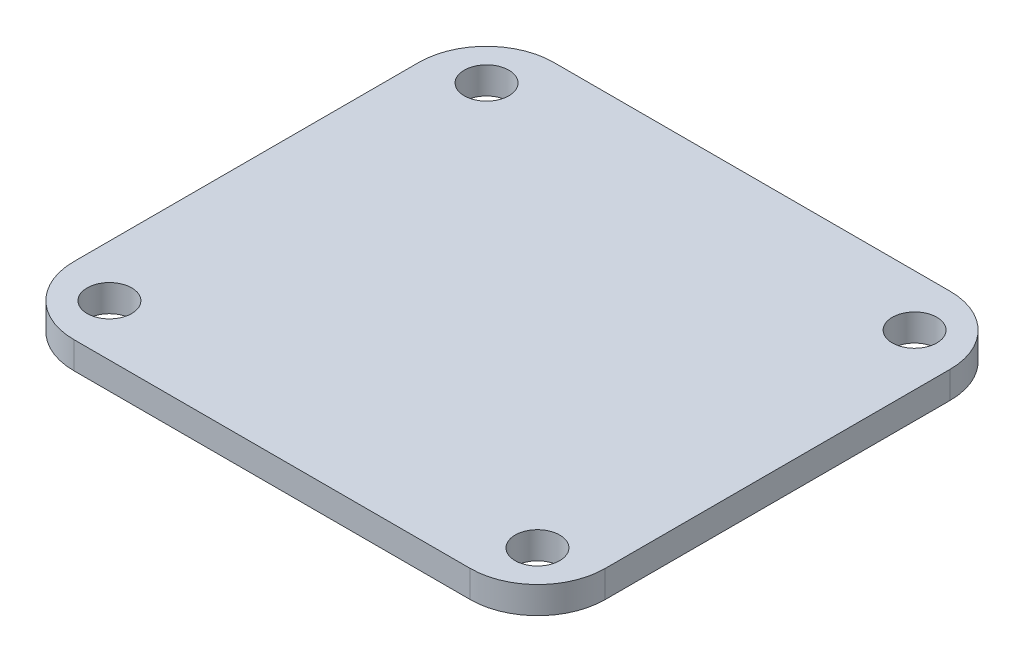
ISO-10303-21;
HEADER;
FILE_DESCRIPTION(('STEP AP214'),'2;1');
FILE_NAME('part.step','',(''),(''),'','','');
FILE_SCHEMA(('AUTOMOTIVE_DESIGN { 1 0 10303 214 1 1 1 1 }'));
ENDSEC;
DATA;
#1=APPLICATION_CONTEXT('core data for automotive mechanical design processes');
#2=APPLICATION_PROTOCOL_DEFINITION('international standard','automotive_design',2000,#1);
#3=PRODUCT_CONTEXT('',#1,'mechanical');
#4=PRODUCT('Part','Part','',(#3));
#5=PRODUCT_RELATED_PRODUCT_CATEGORY('part','',(#4));
#6=PRODUCT_DEFINITION_FORMATION('','',#4);
#7=PRODUCT_DEFINITION_CONTEXT('part definition',#1,'design');
#8=PRODUCT_DEFINITION('design','',#6,#7);
#9=PRODUCT_DEFINITION_SHAPE('','',#8);
#10=(LENGTH_UNIT() NAMED_UNIT(*) SI_UNIT(.MILLI.,.METRE.));
#11=(NAMED_UNIT(*) PLANE_ANGLE_UNIT() SI_UNIT($,.RADIAN.));
#12=(NAMED_UNIT(*) SI_UNIT($,.STERADIAN.) SOLID_ANGLE_UNIT());
#13=UNCERTAINTY_MEASURE_WITH_UNIT(LENGTH_MEASURE(1.E-05),#10,'distance_accuracy_value','');
#14=(GEOMETRIC_REPRESENTATION_CONTEXT(3) GLOBAL_UNCERTAINTY_ASSIGNED_CONTEXT((#13)) GLOBAL_UNIT_ASSIGNED_CONTEXT((#10,
#11,#12)) REPRESENTATION_CONTEXT('',''));
#15=CARTESIAN_POINT('',(0.,0.,0.));
#16=DIRECTION('',(0.,0.,1.));
#17=DIRECTION('',(1.,0.,0.));
#18=AXIS2_PLACEMENT_3D('',#15,#16,#17);
#19=CARTESIAN_POINT('',(0.,2.,0.));
#20=DIRECTION('',(0.,1.,0.));
#21=DIRECTION('',(0.,0.,1.));
#22=AXIS2_PLACEMENT_3D('',#19,#20,#21);
#23=PLANE('',#22);
#24=CARTESIAN_POINT('',(-15.855,2.,13.97));
#25=DIRECTION('',(0.,1.,0.));
#26=DIRECTION('',(0.,0.,1.));
#27=AXIS2_PLACEMENT_3D('',#24,#25,#26);
#28=CIRCLE('',#27,1.65);
#29=CARTESIAN_POINT('',(-15.855,2.,15.62));
#30=VERTEX_POINT('',#29);
#31=EDGE_CURVE('E180',#30,#30,#28,.T.);
#32=ORIENTED_EDGE('',*,*,#31,.F.);
#33=EDGE_LOOP('',(#32));
#34=FACE_BOUND('',#33,.T.);
#35=CARTESIAN_POINT('',(-15.855,2.,-13.97));
#36=DIRECTION('',(0.,1.,0.));
#37=DIRECTION('',(0.,0.,1.));
#38=AXIS2_PLACEMENT_3D('',#35,#36,#37);
#39=CIRCLE('',#38,1.65);
#40=CARTESIAN_POINT('',(-15.855,2.,-12.32));
#41=VERTEX_POINT('',#40);
#42=EDGE_CURVE('E163',#41,#41,#39,.T.);
#43=ORIENTED_EDGE('',*,*,#42,.F.);
#44=EDGE_LOOP('',(#43));
#45=FACE_BOUND('',#44,.T.);
#46=DIRECTION('',(-1.,0.,0.));
#47=VECTOR('',#46,1.);
#48=CARTESIAN_POINT('',(-19.685,2.,-17.78));
#49=LINE('',#48,#47);
#50=CARTESIAN_POINT('',(14.685,2.,-17.78));
#51=VERTEX_POINT('',#50);
#52=CARTESIAN_POINT('',(-14.685,2.,-17.78));
#53=VERTEX_POINT('',#52);
#54=EDGE_CURVE('E170',#51,#53,#49,.T.);
#55=ORIENTED_EDGE('',*,*,#54,.T.);
#56=CARTESIAN_POINT('',(-14.685,2.,-12.78));
#57=DIRECTION('',(0.,1.,0.));
#58=DIRECTION('',(0.,0.,1.));
#59=AXIS2_PLACEMENT_3D('',#56,#57,#58);
#60=CIRCLE('',#59,5.);
#61=CARTESIAN_POINT('',(-19.685,2.,-12.78));
#62=VERTEX_POINT('',#61);
#63=EDGE_CURVE('E147',#53,#62,#60,.T.);
#64=ORIENTED_EDGE('',*,*,#63,.T.);
#65=DIRECTION('',(0.,0.,1.));
#66=VECTOR('',#65,1.);
#67=CARTESIAN_POINT('',(-19.685,2.,-17.78));
#68=LINE('',#67,#66);
#69=CARTESIAN_POINT('',(-19.685,2.,12.78));
#70=VERTEX_POINT('',#69);
#71=EDGE_CURVE('E117',#62,#70,#68,.T.);
#72=ORIENTED_EDGE('',*,*,#71,.T.);
#73=CARTESIAN_POINT('',(-14.685,2.,12.78));
#74=DIRECTION('',(0.,1.,0.));
#75=DIRECTION('',(0.,0.,1.));
#76=AXIS2_PLACEMENT_3D('',#73,#74,#75);
#77=CIRCLE('',#76,5.);
#78=CARTESIAN_POINT('',(-14.685,2.,17.78));
#79=VERTEX_POINT('',#78);
#80=EDGE_CURVE('E54',#70,#79,#77,.T.);
#81=ORIENTED_EDGE('',*,*,#80,.T.);
#82=DIRECTION('',(1.,0.,0.));
#83=VECTOR('',#82,1.);
#84=CARTESIAN_POINT('',(-19.685,2.,17.78));
#85=LINE('',#84,#83);
#86=CARTESIAN_POINT('',(14.685,2.,17.78));
#87=VERTEX_POINT('',#86);
#88=EDGE_CURVE('E133',#79,#87,#85,.T.);
#89=ORIENTED_EDGE('',*,*,#88,.T.);
#90=CARTESIAN_POINT('',(14.685,2.,12.78));
#91=DIRECTION('',(0.,1.,0.));
#92=DIRECTION('',(0.,0.,1.));
#93=AXIS2_PLACEMENT_3D('',#90,#91,#92);
#94=CIRCLE('',#93,5.);
#95=CARTESIAN_POINT('',(19.685,2.,12.78));
#96=VERTEX_POINT('',#95);
#97=EDGE_CURVE('E142',#87,#96,#94,.T.);
#98=ORIENTED_EDGE('',*,*,#97,.T.);
#99=DIRECTION('',(0.,0.,-1.));
#100=VECTOR('',#99,1.);
#101=CARTESIAN_POINT('',(19.685,2.,-17.78));
#102=LINE('',#101,#100);
#103=CARTESIAN_POINT('',(19.685,2.,-12.78));
#104=VERTEX_POINT('',#103);
#105=EDGE_CURVE('E127',#96,#104,#102,.T.);
#106=ORIENTED_EDGE('',*,*,#105,.T.);
#107=CARTESIAN_POINT('',(14.685,2.,-12.78));
#108=DIRECTION('',(0.,1.,0.));
#109=DIRECTION('',(0.,0.,1.));
#110=AXIS2_PLACEMENT_3D('',#107,#108,#109);
#111=CIRCLE('',#110,5.);
#112=EDGE_CURVE('E144',#104,#51,#111,.T.);
#113=ORIENTED_EDGE('',*,*,#112,.T.);
#114=EDGE_LOOP('',(#55,#64,#72,#81,#89,#98,#106,#113));
#115=FACE_BOUND('',#114,.T.);
#116=CARTESIAN_POINT('',(15.855,2.,-13.97));
#117=DIRECTION('',(0.,1.,0.));
#118=DIRECTION('',(0.,0.,1.));
#119=AXIS2_PLACEMENT_3D('',#116,#117,#118);
#120=CIRCLE('',#119,1.65);
#121=CARTESIAN_POINT('',(15.855,2.,-12.32));
#122=VERTEX_POINT('',#121);
#123=EDGE_CURVE('E175',#122,#122,#120,.T.);
#124=ORIENTED_EDGE('',*,*,#123,.F.);
#125=EDGE_LOOP('',(#124));
#126=FACE_BOUND('',#125,.T.);
#127=CARTESIAN_POINT('',(15.855,2.,13.97));
#128=DIRECTION('',(0.,1.,0.));
#129=DIRECTION('',(0.,0.,1.));
#130=AXIS2_PLACEMENT_3D('',#127,#128,#129);
#131=CIRCLE('',#130,1.65);
#132=CARTESIAN_POINT('',(15.855,2.,15.62));
#133=VERTEX_POINT('',#132);
#134=EDGE_CURVE('E186',#133,#133,#131,.T.);
#135=ORIENTED_EDGE('',*,*,#134,.F.);
#136=EDGE_LOOP('',(#135));
#137=FACE_BOUND('',#136,.T.);
#138=ADVANCED_FACE('F32',(#34,#45,#115,#126,#137),#23,.T.);
#139=CARTESIAN_POINT('',(0.,0.,0.));
#140=DIRECTION('',(0.,1.,0.));
#141=DIRECTION('',(0.,0.,1.));
#142=AXIS2_PLACEMENT_3D('',#139,#140,#141);
#143=PLANE('',#142);
#144=CARTESIAN_POINT('',(-15.855,0.,13.97));
#145=DIRECTION('',(0.,1.,0.));
#146=DIRECTION('',(0.,0.,1.));
#147=AXIS2_PLACEMENT_3D('',#144,#145,#146);
#148=CIRCLE('',#147,1.65);
#149=CARTESIAN_POINT('',(-15.855,0.,15.62));
#150=VERTEX_POINT('',#149);
#151=EDGE_CURVE('E183',#150,#150,#148,.T.);
#152=ORIENTED_EDGE('',*,*,#151,.T.);
#153=EDGE_LOOP('',(#152));
#154=FACE_BOUND('',#153,.T.);
#155=CARTESIAN_POINT('',(-15.855,0.,-13.97));
#156=DIRECTION('',(0.,1.,0.));
#157=DIRECTION('',(0.,0.,1.));
#158=AXIS2_PLACEMENT_3D('',#155,#156,#157);
#159=CIRCLE('',#158,1.65);
#160=CARTESIAN_POINT('',(-15.855,0.,-12.32));
#161=VERTEX_POINT('',#160);
#162=EDGE_CURVE('E165',#161,#161,#159,.T.);
#163=ORIENTED_EDGE('',*,*,#162,.T.);
#164=EDGE_LOOP('',(#163));
#165=FACE_BOUND('',#164,.T.);
#166=DIRECTION('',(0.,0.,1.));
#167=VECTOR('',#166,1.);
#168=CARTESIAN_POINT('',(-19.685,0.,-17.78));
#169=LINE('',#168,#167);
#170=CARTESIAN_POINT('',(-19.685,0.,-12.78));
#171=VERTEX_POINT('',#170);
#172=CARTESIAN_POINT('',(-19.685,0.,12.78));
#173=VERTEX_POINT('',#172);
#174=EDGE_CURVE('E115',#171,#173,#169,.T.);
#175=ORIENTED_EDGE('',*,*,#174,.F.);
#176=CARTESIAN_POINT('',(-14.685,0.,-12.78));
#177=DIRECTION('',(0.,1.,0.));
#178=DIRECTION('',(0.,0.,1.));
#179=AXIS2_PLACEMENT_3D('',#176,#177,#178);
#180=CIRCLE('',#179,5.);
#181=CARTESIAN_POINT('',(-14.685,0.,-17.78));
#182=VERTEX_POINT('',#181);
#183=EDGE_CURVE('E98',#171,#182,#180,.F.);
#184=ORIENTED_EDGE('',*,*,#183,.T.);
#185=DIRECTION('',(-1.,0.,0.));
#186=VECTOR('',#185,1.);
#187=CARTESIAN_POINT('',(-19.685,0.,-17.78));
#188=LINE('',#187,#186);
#189=CARTESIAN_POINT('',(14.685,0.,-17.78));
#190=VERTEX_POINT('',#189);
#191=EDGE_CURVE('E125',#190,#182,#188,.T.);
#192=ORIENTED_EDGE('',*,*,#191,.F.);
#193=CARTESIAN_POINT('',(14.685,0.,-12.78));
#194=DIRECTION('',(0.,1.,0.));
#195=DIRECTION('',(0.,0.,1.));
#196=AXIS2_PLACEMENT_3D('',#193,#194,#195);
#197=CIRCLE('',#196,5.);
#198=CARTESIAN_POINT('',(19.685,0.,-12.78));
#199=VERTEX_POINT('',#198);
#200=EDGE_CURVE('E136',#190,#199,#197,.F.);
#201=ORIENTED_EDGE('',*,*,#200,.T.);
#202=DIRECTION('',(0.,0.,-1.));
#203=VECTOR('',#202,1.);
#204=CARTESIAN_POINT('',(19.685,0.,-17.78));
#205=LINE('',#204,#203);
#206=CARTESIAN_POINT('',(19.685,0.,12.78));
#207=VERTEX_POINT('',#206);
#208=EDGE_CURVE('E129',#207,#199,#205,.T.);
#209=ORIENTED_EDGE('',*,*,#208,.F.);
#210=CARTESIAN_POINT('',(14.685,0.,12.78));
#211=DIRECTION('',(0.,1.,0.));
#212=DIRECTION('',(0.,0.,1.));
#213=AXIS2_PLACEMENT_3D('',#210,#211,#212);
#214=CIRCLE('',#213,5.);
#215=CARTESIAN_POINT('',(14.685,0.,17.78));
#216=VERTEX_POINT('',#215);
#217=EDGE_CURVE('E118',#207,#216,#214,.F.);
#218=ORIENTED_EDGE('',*,*,#217,.T.);
#219=DIRECTION('',(1.,0.,0.));
#220=VECTOR('',#219,1.);
#221=CARTESIAN_POINT('',(-19.685,0.,17.78));
#222=LINE('',#221,#220);
#223=CARTESIAN_POINT('',(-14.685,0.,17.78));
#224=VERTEX_POINT('',#223);
#225=EDGE_CURVE('E124',#224,#216,#222,.T.);
#226=ORIENTED_EDGE('',*,*,#225,.F.);
#227=CARTESIAN_POINT('',(-14.685,0.,12.78));
#228=DIRECTION('',(0.,1.,0.));
#229=DIRECTION('',(0.,0.,1.));
#230=AXIS2_PLACEMENT_3D('',#227,#228,#229);
#231=CIRCLE('',#230,5.);
#232=EDGE_CURVE('E109',#224,#173,#231,.F.);
#233=ORIENTED_EDGE('',*,*,#232,.T.);
#234=EDGE_LOOP('',(#175,#184,#192,#201,#209,#218,#226,#233));
#235=FACE_BOUND('',#234,.T.);
#236=CARTESIAN_POINT('',(15.855,0.,-13.97));
#237=DIRECTION('',(0.,1.,0.));
#238=DIRECTION('',(0.,0.,1.));
#239=AXIS2_PLACEMENT_3D('',#236,#237,#238);
#240=CIRCLE('',#239,1.65);
#241=CARTESIAN_POINT('',(15.855,0.,-12.32));
#242=VERTEX_POINT('',#241);
#243=EDGE_CURVE('E177',#242,#242,#240,.T.);
#244=ORIENTED_EDGE('',*,*,#243,.T.);
#245=EDGE_LOOP('',(#244));
#246=FACE_BOUND('',#245,.T.);
#247=CARTESIAN_POINT('',(15.855,0.,13.97));
#248=DIRECTION('',(0.,1.,0.));
#249=DIRECTION('',(0.,0.,1.));
#250=AXIS2_PLACEMENT_3D('',#247,#248,#249);
#251=CIRCLE('',#250,1.65);
#252=CARTESIAN_POINT('',(15.855,0.,15.62));
#253=VERTEX_POINT('',#252);
#254=EDGE_CURVE('E189',#253,#253,#251,.T.);
#255=ORIENTED_EDGE('',*,*,#254,.T.);
#256=EDGE_LOOP('',(#255));
#257=FACE_BOUND('',#256,.T.);
#258=ADVANCED_FACE('F121',(#154,#165,#235,#246,#257),#143,.F.);
#259=CARTESIAN_POINT('',(19.685,2.,-17.78));
#260=DIRECTION('',(-1.,0.,0.));
#261=DIRECTION('',(0.,0.,1.));
#262=AXIS2_PLACEMENT_3D('',#259,#260,#261);
#263=PLANE('',#262);
#264=ORIENTED_EDGE('',*,*,#208,.T.);
#265=DIRECTION('',(0.,-1.,0.));
#266=VECTOR('',#265,1.);
#267=CARTESIAN_POINT('',(19.685,2.,-12.78));
#268=LINE('',#267,#266);
#269=EDGE_CURVE('E11',#199,#104,#268,.F.);
#270=ORIENTED_EDGE('',*,*,#269,.T.);
#271=ORIENTED_EDGE('',*,*,#105,.F.);
#272=DIRECTION('',(0.,-1.,0.));
#273=VECTOR('',#272,1.);
#274=CARTESIAN_POINT('',(19.685,2.,12.78));
#275=LINE('',#274,#273);
#276=EDGE_CURVE('E40',#96,#207,#275,.T.);
#277=ORIENTED_EDGE('',*,*,#276,.T.);
#278=EDGE_LOOP('',(#264,#270,#271,#277));
#279=FACE_BOUND('',#278,.T.);
#280=ADVANCED_FACE('F158',(#279),#263,.F.);
#281=CARTESIAN_POINT('',(-19.685,2.,-17.78));
#282=DIRECTION('',(0.,0.,1.));
#283=DIRECTION('',(1.,0.,0.));
#284=AXIS2_PLACEMENT_3D('',#281,#282,#283);
#285=PLANE('',#284);
#286=ORIENTED_EDGE('',*,*,#191,.T.);
#287=DIRECTION('',(0.,-1.,0.));
#288=VECTOR('',#287,1.);
#289=CARTESIAN_POINT('',(-14.685,2.,-17.78));
#290=LINE('',#289,#288);
#291=EDGE_CURVE('E103',#182,#53,#290,.F.);
#292=ORIENTED_EDGE('',*,*,#291,.T.);
#293=ORIENTED_EDGE('',*,*,#54,.F.);
#294=DIRECTION('',(0.,-1.,0.));
#295=VECTOR('',#294,1.);
#296=CARTESIAN_POINT('',(14.685,2.,-17.78));
#297=LINE('',#296,#295);
#298=EDGE_CURVE('E108',#51,#190,#297,.T.);
#299=ORIENTED_EDGE('',*,*,#298,.T.);
#300=EDGE_LOOP('',(#286,#292,#293,#299));
#301=FACE_BOUND('',#300,.T.);
#302=ADVANCED_FACE('F217',(#301),#285,.F.);
#303=CARTESIAN_POINT('',(-19.685,2.,-17.78));
#304=DIRECTION('',(1.,0.,0.));
#305=DIRECTION('',(0.,0.,-1.));
#306=AXIS2_PLACEMENT_3D('',#303,#304,#305);
#307=PLANE('',#306);
#308=ORIENTED_EDGE('',*,*,#71,.F.);
#309=DIRECTION('',(0.,-1.,0.));
#310=VECTOR('',#309,1.);
#311=CARTESIAN_POINT('',(-19.685,2.,-12.78));
#312=LINE('',#311,#310);
#313=EDGE_CURVE('E102',#62,#171,#312,.T.);
#314=ORIENTED_EDGE('',*,*,#313,.T.);
#315=ORIENTED_EDGE('',*,*,#174,.T.);
#316=DIRECTION('',(0.,-1.,0.));
#317=VECTOR('',#316,1.);
#318=CARTESIAN_POINT('',(-19.685,2.,12.78));
#319=LINE('',#318,#317);
#320=EDGE_CURVE('E119',#173,#70,#319,.F.);
#321=ORIENTED_EDGE('',*,*,#320,.T.);
#322=EDGE_LOOP('',(#308,#314,#315,#321));
#323=FACE_BOUND('',#322,.T.);
#324=ADVANCED_FACE('F114',(#323),#307,.F.);
#325=CARTESIAN_POINT('',(-19.685,2.,17.78));
#326=DIRECTION('',(0.,0.,-1.));
#327=DIRECTION('',(-1.,0.,0.));
#328=AXIS2_PLACEMENT_3D('',#325,#326,#327);
#329=PLANE('',#328);
#330=ORIENTED_EDGE('',*,*,#88,.F.);
#331=DIRECTION('',(0.,-1.,0.));
#332=VECTOR('',#331,1.);
#333=CARTESIAN_POINT('',(-14.685,2.,17.78));
#334=LINE('',#333,#332);
#335=EDGE_CURVE('E150',#79,#224,#334,.T.);
#336=ORIENTED_EDGE('',*,*,#335,.T.);
#337=ORIENTED_EDGE('',*,*,#225,.T.);
#338=DIRECTION('',(0.,-1.,0.));
#339=VECTOR('',#338,1.);
#340=CARTESIAN_POINT('',(14.685,2.,17.78));
#341=LINE('',#340,#339);
#342=EDGE_CURVE('E47',#216,#87,#341,.F.);
#343=ORIENTED_EDGE('',*,*,#342,.T.);
#344=EDGE_LOOP('',(#330,#336,#337,#343));
#345=FACE_BOUND('',#344,.T.);
#346=ADVANCED_FACE('F212',(#345),#329,.F.);
#347=CARTESIAN_POINT('',(-15.855,2.,-13.97));
#348=DIRECTION('',(0.,-1.,0.));
#349=DIRECTION('',(0.,0.,-1.));
#350=AXIS2_PLACEMENT_3D('',#347,#348,#349);
#351=CYLINDRICAL_SURFACE('',#350,1.65);
#352=ORIENTED_EDGE('',*,*,#42,.T.);
#353=EDGE_LOOP('',(#352));
#354=FACE_BOUND('',#353,.T.);
#355=ORIENTED_EDGE('',*,*,#162,.F.);
#356=EDGE_LOOP('',(#355));
#357=FACE_BOUND('',#356,.T.);
#358=ADVANCED_FACE('F209',(#354,#357),#351,.F.);
#359=CARTESIAN_POINT('',(15.855,2.,-13.97));
#360=DIRECTION('',(0.,-1.,0.));
#361=DIRECTION('',(0.,0.,-1.));
#362=AXIS2_PLACEMENT_3D('',#359,#360,#361);
#363=CYLINDRICAL_SURFACE('',#362,1.65);
#364=ORIENTED_EDGE('',*,*,#123,.T.);
#365=EDGE_LOOP('',(#364));
#366=FACE_BOUND('',#365,.T.);
#367=ORIENTED_EDGE('',*,*,#243,.F.);
#368=EDGE_LOOP('',(#367));
#369=FACE_BOUND('',#368,.T.);
#370=ADVANCED_FACE('F241',(#366,#369),#363,.F.);
#371=CARTESIAN_POINT('',(-15.855,2.,13.97));
#372=DIRECTION('',(0.,-1.,0.));
#373=DIRECTION('',(0.,0.,-1.));
#374=AXIS2_PLACEMENT_3D('',#371,#372,#373);
#375=CYLINDRICAL_SURFACE('',#374,1.65);
#376=ORIENTED_EDGE('',*,*,#31,.T.);
#377=EDGE_LOOP('',(#376));
#378=FACE_BOUND('',#377,.T.);
#379=ORIENTED_EDGE('',*,*,#151,.F.);
#380=EDGE_LOOP('',(#379));
#381=FACE_BOUND('',#380,.T.);
#382=ADVANCED_FACE('F244',(#378,#381),#375,.F.);
#383=CARTESIAN_POINT('',(15.855,2.,13.97));
#384=DIRECTION('',(0.,-1.,0.));
#385=DIRECTION('',(0.,0.,-1.));
#386=AXIS2_PLACEMENT_3D('',#383,#384,#385);
#387=CYLINDRICAL_SURFACE('',#386,1.65);
#388=ORIENTED_EDGE('',*,*,#134,.T.);
#389=EDGE_LOOP('',(#388));
#390=FACE_BOUND('',#389,.T.);
#391=ORIENTED_EDGE('',*,*,#254,.F.);
#392=EDGE_LOOP('',(#391));
#393=FACE_BOUND('',#392,.T.);
#394=ADVANCED_FACE('F195',(#390,#393),#387,.F.);
#395=CARTESIAN_POINT('',(-14.685,2.,-12.78));
#396=DIRECTION('',(0.,-1.,0.));
#397=DIRECTION('',(0.,0.,-1.));
#398=AXIS2_PLACEMENT_3D('',#395,#396,#397);
#399=CYLINDRICAL_SURFACE('',#398,5.);
#400=ORIENTED_EDGE('',*,*,#63,.F.);
#401=ORIENTED_EDGE('',*,*,#291,.F.);
#402=ORIENTED_EDGE('',*,*,#183,.F.);
#403=ORIENTED_EDGE('',*,*,#313,.F.);
#404=EDGE_LOOP('',(#400,#401,#402,#403));
#405=FACE_BOUND('',#404,.T.);
#406=ADVANCED_FACE('F101',(#405),#399,.T.);
#407=CARTESIAN_POINT('',(-14.685,2.,12.78));
#408=DIRECTION('',(0.,-1.,0.));
#409=DIRECTION('',(0.,0.,-1.));
#410=AXIS2_PLACEMENT_3D('',#407,#408,#409);
#411=CYLINDRICAL_SURFACE('',#410,5.);
#412=ORIENTED_EDGE('',*,*,#80,.F.);
#413=ORIENTED_EDGE('',*,*,#320,.F.);
#414=ORIENTED_EDGE('',*,*,#232,.F.);
#415=ORIENTED_EDGE('',*,*,#335,.F.);
#416=EDGE_LOOP('',(#412,#413,#414,#415));
#417=FACE_BOUND('',#416,.T.);
#418=ADVANCED_FACE('F225',(#417),#411,.T.);
#419=CARTESIAN_POINT('',(14.685,2.,-12.78));
#420=DIRECTION('',(0.,-1.,0.));
#421=DIRECTION('',(0.,0.,-1.));
#422=AXIS2_PLACEMENT_3D('',#419,#420,#421);
#423=CYLINDRICAL_SURFACE('',#422,5.);
#424=ORIENTED_EDGE('',*,*,#112,.F.);
#425=ORIENTED_EDGE('',*,*,#269,.F.);
#426=ORIENTED_EDGE('',*,*,#200,.F.);
#427=ORIENTED_EDGE('',*,*,#298,.F.);
#428=EDGE_LOOP('',(#424,#425,#426,#427));
#429=FACE_BOUND('',#428,.T.);
#430=ADVANCED_FACE('F227',(#429),#423,.T.);
#431=CARTESIAN_POINT('',(14.685,2.,12.78));
#432=DIRECTION('',(0.,-1.,0.));
#433=DIRECTION('',(0.,0.,-1.));
#434=AXIS2_PLACEMENT_3D('',#431,#432,#433);
#435=CYLINDRICAL_SURFACE('',#434,5.);
#436=ORIENTED_EDGE('',*,*,#97,.F.);
#437=ORIENTED_EDGE('',*,*,#342,.F.);
#438=ORIENTED_EDGE('',*,*,#217,.F.);
#439=ORIENTED_EDGE('',*,*,#276,.F.);
#440=EDGE_LOOP('',(#436,#437,#438,#439));
#441=FACE_BOUND('',#440,.T.);
#442=ADVANCED_FACE('F34',(#441),#435,.T.);
#443=CLOSED_SHELL('',(#138,#258,#280,#302,#324,#346,#358,#370,#382,#394,#406,#418,#430,#442));
#444=MANIFOLD_SOLID_BREP('B2',#443);
#445=ADVANCED_BREP_SHAPE_REPRESENTATION('',(#18,#444),#14);
#446=SHAPE_DEFINITION_REPRESENTATION(#9,#445);
ENDSEC;
END-ISO-10303-21;
